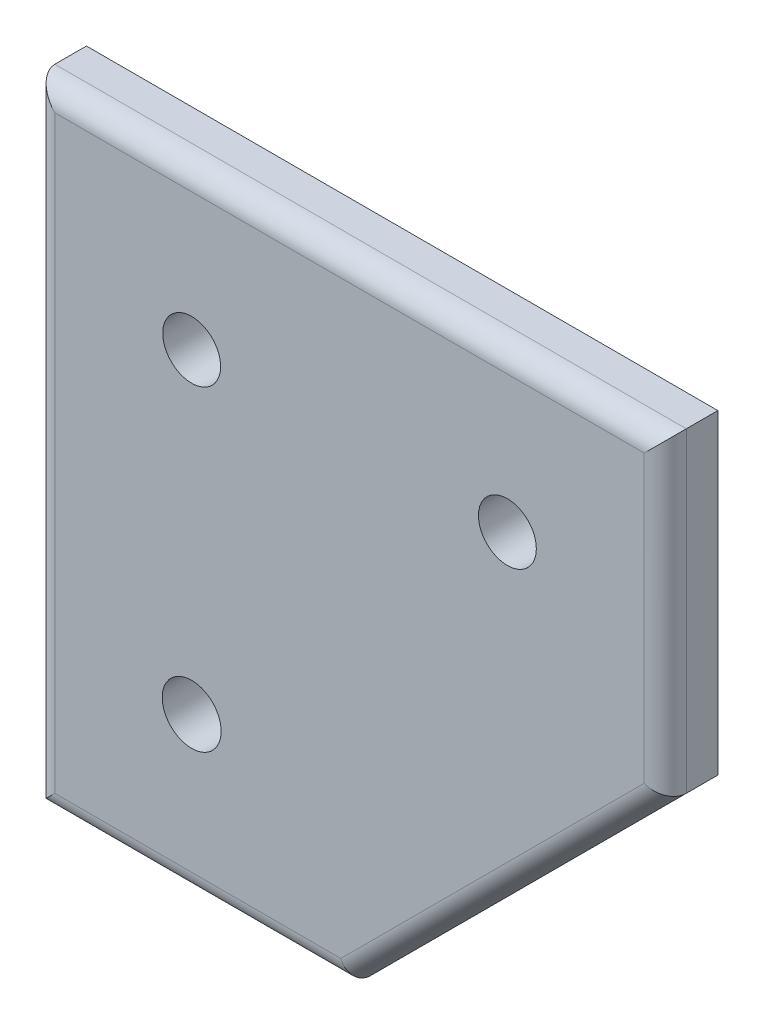
ISO-10303-21;
HEADER;
FILE_DESCRIPTION(('STEP AP214'),'2;1');
FILE_NAME('part.step','',(''),(''),'','','');
FILE_SCHEMA(('AUTOMOTIVE_DESIGN { 1 0 10303 214 1 1 1 1 }'));
ENDSEC;
DATA;
#1=APPLICATION_CONTEXT('core data for automotive mechanical design processes');
#2=APPLICATION_PROTOCOL_DEFINITION('international standard','automotive_design',2000,#1);
#3=PRODUCT_CONTEXT('',#1,'mechanical');
#4=PRODUCT('Part','Part','',(#3));
#5=PRODUCT_RELATED_PRODUCT_CATEGORY('part','',(#4));
#6=PRODUCT_DEFINITION_FORMATION('','',#4);
#7=PRODUCT_DEFINITION_CONTEXT('part definition',#1,'design');
#8=PRODUCT_DEFINITION('design','',#6,#7);
#9=PRODUCT_DEFINITION_SHAPE('','',#8);
#10=(LENGTH_UNIT() NAMED_UNIT(*) SI_UNIT(.MILLI.,.METRE.));
#11=(NAMED_UNIT(*) PLANE_ANGLE_UNIT() SI_UNIT($,.RADIAN.));
#12=(NAMED_UNIT(*) SI_UNIT($,.STERADIAN.) SOLID_ANGLE_UNIT());
#13=UNCERTAINTY_MEASURE_WITH_UNIT(LENGTH_MEASURE(1.E-05),#10,'distance_accuracy_value','');
#14=(GEOMETRIC_REPRESENTATION_CONTEXT(3) GLOBAL_UNCERTAINTY_ASSIGNED_CONTEXT((#13)) GLOBAL_UNIT_ASSIGNED_CONTEXT((#10,
#11,#12)) REPRESENTATION_CONTEXT('',''));
#15=CARTESIAN_POINT('',(0.,0.,0.));
#16=DIRECTION('',(0.,0.,1.));
#17=DIRECTION('',(1.,0.,0.));
#18=AXIS2_PLACEMENT_3D('',#15,#16,#17);
#19=CARTESIAN_POINT('',(0.,-38.1,6.35));
#20=DIRECTION('',(0.,1.,0.));
#21=DIRECTION('',(0.,0.,1.));
#22=AXIS2_PLACEMENT_3D('',#19,#20,#21);
#23=PLANE('',#22);
#24=DIRECTION('',(0.,0.,-1.));
#25=VECTOR('',#24,1.);
#26=CARTESIAN_POINT('',(38.1,-38.1,6.35));
#27=LINE('',#26,#25);
#28=CARTESIAN_POINT('',(38.1,-38.1,3.81));
#29=VERTEX_POINT('',#28);
#30=CARTESIAN_POINT('',(38.1,-38.1,0.));
#31=VERTEX_POINT('',#30);
#32=EDGE_CURVE('E113',#29,#31,#27,.T.);
#33=ORIENTED_EDGE('',*,*,#32,.F.);
#34=DIRECTION('',(1.,0.,0.));
#35=VECTOR('',#34,1.);
#36=CARTESIAN_POINT('',(0.,-38.1,3.81));
#37=LINE('',#36,#35);
#38=CARTESIAN_POINT('',(0.,-38.1,3.81));
#39=VERTEX_POINT('',#38);
#40=EDGE_CURVE('E111',#29,#39,#37,.F.);
#41=ORIENTED_EDGE('',*,*,#40,.T.);
#42=DIRECTION('',(0.,0.,-1.));
#43=VECTOR('',#42,1.);
#44=CARTESIAN_POINT('',(0.,-38.1,6.35));
#45=LINE('',#44,#43);
#46=CARTESIAN_POINT('',(0.,-38.1,0.));
#47=VERTEX_POINT('',#46);
#48=EDGE_CURVE('E104',#39,#47,#45,.T.);
#49=ORIENTED_EDGE('',*,*,#48,.T.);
#50=DIRECTION('',(1.,0.,0.));
#51=VECTOR('',#50,1.);
#52=CARTESIAN_POINT('',(0.,-38.1,0.));
#53=LINE('',#52,#51);
#54=EDGE_CURVE('E108',#47,#31,#53,.T.);
#55=ORIENTED_EDGE('',*,*,#54,.T.);
#56=EDGE_LOOP('',(#33,#41,#49,#55));
#57=FACE_BOUND('',#56,.T.);
#58=ADVANCED_FACE('F43',(#57),#23,.F.);
#59=CARTESIAN_POINT('',(38.1,-38.1,6.35));
#60=DIRECTION('',(-0.707106781186548,0.707106781186547,0.));
#61=DIRECTION('',(-0.707106781186547,-0.707106781186548,0.));
#62=AXIS2_PLACEMENT_3D('',#59,#60,#61);
#63=PLANE('',#62);
#64=DIRECTION('',(0.,0.,-1.));
#65=VECTOR('',#64,1.);
#66=CARTESIAN_POINT('',(76.2,0.,6.35));
#67=LINE('',#66,#65);
#68=CARTESIAN_POINT('',(76.2,0.,3.81));
#69=VERTEX_POINT('',#68);
#70=CARTESIAN_POINT('',(76.2,0.,0.));
#71=VERTEX_POINT('',#70);
#72=EDGE_CURVE('E143',#69,#71,#67,.T.);
#73=ORIENTED_EDGE('',*,*,#72,.F.);
#74=DIRECTION('',(0.707106781186547,0.707106781186548,0.));
#75=VECTOR('',#74,1.);
#76=CARTESIAN_POINT('',(38.1,-38.1,3.81));
#77=LINE('',#76,#75);
#78=EDGE_CURVE('E156',#69,#29,#77,.F.);
#79=ORIENTED_EDGE('',*,*,#78,.T.);
#80=ORIENTED_EDGE('',*,*,#32,.T.);
#81=DIRECTION('',(0.707106781186548,0.707106781186548,0.));
#82=VECTOR('',#81,1.);
#83=CARTESIAN_POINT('',(38.1,-38.1,0.));
#84=LINE('',#83,#82);
#85=EDGE_CURVE('E127',#31,#71,#84,.T.);
#86=ORIENTED_EDGE('',*,*,#85,.T.);
#87=EDGE_LOOP('',(#73,#79,#80,#86));
#88=FACE_BOUND('',#87,.T.);
#89=ADVANCED_FACE('F214',(#88),#63,.F.);
#90=CARTESIAN_POINT('',(76.2,0.,6.35));
#91=DIRECTION('',(-1.,0.,0.));
#92=DIRECTION('',(0.,0.,1.));
#93=AXIS2_PLACEMENT_3D('',#90,#91,#92);
#94=PLANE('',#93);
#95=DIRECTION('',(0.,0.,-1.));
#96=VECTOR('',#95,1.);
#97=CARTESIAN_POINT('',(76.2,38.1,6.35));
#98=LINE('',#97,#96);
#99=CARTESIAN_POINT('',(76.2,38.1,3.81));
#100=VERTEX_POINT('',#99);
#101=CARTESIAN_POINT('',(76.2,38.1,0.));
#102=VERTEX_POINT('',#101);
#103=EDGE_CURVE('E141',#100,#102,#98,.T.);
#104=ORIENTED_EDGE('',*,*,#103,.F.);
#105=DIRECTION('',(0.,1.,0.));
#106=VECTOR('',#105,1.);
#107=CARTESIAN_POINT('',(76.2,0.,3.81));
#108=LINE('',#107,#106);
#109=EDGE_CURVE('E160',#100,#69,#108,.F.);
#110=ORIENTED_EDGE('',*,*,#109,.T.);
#111=ORIENTED_EDGE('',*,*,#72,.T.);
#112=DIRECTION('',(0.,1.,0.));
#113=VECTOR('',#112,1.);
#114=CARTESIAN_POINT('',(76.2,0.,0.));
#115=LINE('',#114,#113);
#116=EDGE_CURVE('E130',#71,#102,#115,.T.);
#117=ORIENTED_EDGE('',*,*,#116,.T.);
#118=EDGE_LOOP('',(#104,#110,#111,#117));
#119=FACE_BOUND('',#118,.T.);
#120=ADVANCED_FACE('F220',(#119),#94,.F.);
#121=CARTESIAN_POINT('',(0.,38.1,6.35));
#122=DIRECTION('',(0.,-1.,0.));
#123=DIRECTION('',(0.,0.,-1.));
#124=AXIS2_PLACEMENT_3D('',#121,#122,#123);
#125=PLANE('',#124);
#126=DIRECTION('',(0.,0.,-1.));
#127=VECTOR('',#126,1.);
#128=CARTESIAN_POINT('',(0.,38.1,6.35));
#129=LINE('',#128,#127);
#130=CARTESIAN_POINT('',(0.,38.1,3.81));
#131=VERTEX_POINT('',#130);
#132=CARTESIAN_POINT('',(0.,38.1,0.));
#133=VERTEX_POINT('',#132);
#134=EDGE_CURVE('E118',#131,#133,#129,.T.);
#135=ORIENTED_EDGE('',*,*,#134,.F.);
#136=DIRECTION('',(-1.,0.,0.));
#137=VECTOR('',#136,1.);
#138=CARTESIAN_POINT('',(76.2,38.1,3.81));
#139=LINE('',#138,#137);
#140=EDGE_CURVE('E52',#131,#100,#139,.F.);
#141=ORIENTED_EDGE('',*,*,#140,.T.);
#142=ORIENTED_EDGE('',*,*,#103,.T.);
#143=DIRECTION('',(-1.,0.,0.));
#144=VECTOR('',#143,1.);
#145=CARTESIAN_POINT('',(0.,38.1,0.));
#146=LINE('',#145,#144);
#147=EDGE_CURVE('E122',#102,#133,#146,.T.);
#148=ORIENTED_EDGE('',*,*,#147,.T.);
#149=EDGE_LOOP('',(#135,#141,#142,#148));
#150=FACE_BOUND('',#149,.T.);
#151=ADVANCED_FACE('F209',(#150),#125,.F.);
#152=CARTESIAN_POINT('',(0.,0.,6.35));
#153=DIRECTION('',(1.,0.,0.));
#154=DIRECTION('',(0.,0.,-1.));
#155=AXIS2_PLACEMENT_3D('',#152,#153,#154);
#156=PLANE('',#155);
#157=ORIENTED_EDGE('',*,*,#48,.F.);
#158=DIRECTION('',(0.,-1.,0.));
#159=VECTOR('',#158,1.);
#160=CARTESIAN_POINT('',(0.,38.1,3.81));
#161=LINE('',#160,#159);
#162=EDGE_CURVE('E11',#39,#131,#161,.F.);
#163=ORIENTED_EDGE('',*,*,#162,.T.);
#164=ORIENTED_EDGE('',*,*,#134,.T.);
#165=DIRECTION('',(0.,-1.,0.));
#166=VECTOR('',#165,1.);
#167=CARTESIAN_POINT('',(0.,0.,0.));
#168=LINE('',#167,#166);
#169=EDGE_CURVE('E116',#133,#47,#168,.T.);
#170=ORIENTED_EDGE('',*,*,#169,.T.);
#171=EDGE_LOOP('',(#157,#163,#164,#170));
#172=FACE_BOUND('',#171,.T.);
#173=ADVANCED_FACE('F117',(#172),#156,.F.);
#174=CARTESIAN_POINT('',(0.,0.,6.35));
#175=DIRECTION('',(0.,0.,1.));
#176=DIRECTION('',(1.,0.,0.));
#177=AXIS2_PLACEMENT_3D('',#174,#175,#176);
#178=PLANE('',#177);
#179=DIRECTION('',(1.,0.,0.));
#180=VECTOR('',#179,1.);
#181=CARTESIAN_POINT('',(38.1,-35.56,6.35));
#182=LINE('',#181,#180);
#183=CARTESIAN_POINT('',(2.54,-35.56,6.35));
#184=VERTEX_POINT('',#183);
#185=CARTESIAN_POINT('',(37.0478975515724,-35.56,6.35));
#186=VERTEX_POINT('',#185);
#187=EDGE_CURVE('E151',#184,#186,#182,.T.);
#188=ORIENTED_EDGE('',*,*,#187,.T.);
#189=DIRECTION('',(0.707106781186547,0.707106781186548,0.));
#190=VECTOR('',#189,1.);
#191=CARTESIAN_POINT('',(74.4039487757862,1.79605122421383,6.35));
#192=LINE('',#191,#190);
#193=CARTESIAN_POINT('',(73.66,1.05210244842766,6.35));
#194=VERTEX_POINT('',#193);
#195=EDGE_CURVE('E153',#186,#194,#192,.T.);
#196=ORIENTED_EDGE('',*,*,#195,.T.);
#197=DIRECTION('',(0.,1.,0.));
#198=VECTOR('',#197,1.);
#199=CARTESIAN_POINT('',(73.66,38.1,6.35));
#200=LINE('',#199,#198);
#201=CARTESIAN_POINT('',(73.66,35.56,6.35));
#202=VERTEX_POINT('',#201);
#203=EDGE_CURVE('E149',#194,#202,#200,.T.);
#204=ORIENTED_EDGE('',*,*,#203,.T.);
#205=DIRECTION('',(-1.,0.,0.));
#206=VECTOR('',#205,1.);
#207=CARTESIAN_POINT('',(0.,35.56,6.35));
#208=LINE('',#207,#206);
#209=CARTESIAN_POINT('',(2.54,35.56,6.35));
#210=VERTEX_POINT('',#209);
#211=EDGE_CURVE('E147',#202,#210,#208,.T.);
#212=ORIENTED_EDGE('',*,*,#211,.T.);
#213=DIRECTION('',(0.,-1.,0.));
#214=VECTOR('',#213,1.);
#215=CARTESIAN_POINT('',(2.54,-38.1,6.35));
#216=LINE('',#215,#214);
#217=EDGE_CURVE('E112',#210,#184,#216,.T.);
#218=ORIENTED_EDGE('',*,*,#217,.T.);
#219=EDGE_LOOP('',(#188,#196,#204,#212,#218));
#220=FACE_BOUND('',#219,.T.);
#221=CARTESIAN_POINT('',(19.05,-19.05,6.35));
#222=DIRECTION('',(0.,0.,1.));
#223=DIRECTION('',(1.,0.,0.));
#224=AXIS2_PLACEMENT_3D('',#221,#222,#223);
#225=CIRCLE('',#224,3.556);
#226=CARTESIAN_POINT('',(22.606,-19.05,6.35));
#227=VERTEX_POINT('',#226);
#228=EDGE_CURVE('E180',#227,#227,#225,.T.);
#229=ORIENTED_EDGE('',*,*,#228,.F.);
#230=EDGE_LOOP('',(#229));
#231=FACE_BOUND('',#230,.T.);
#232=CARTESIAN_POINT('',(57.15,19.05,6.35));
#233=DIRECTION('',(0.,0.,1.));
#234=DIRECTION('',(1.,0.,0.));
#235=AXIS2_PLACEMENT_3D('',#232,#233,#234);
#236=CIRCLE('',#235,3.4925);
#237=CARTESIAN_POINT('',(60.6425,19.05,6.35));
#238=VERTEX_POINT('',#237);
#239=EDGE_CURVE('E190',#238,#238,#236,.T.);
#240=ORIENTED_EDGE('',*,*,#239,.F.);
#241=EDGE_LOOP('',(#240));
#242=FACE_BOUND('',#241,.T.);
#243=CARTESIAN_POINT('',(19.05,19.05,6.35));
#244=DIRECTION('',(0.,0.,1.));
#245=DIRECTION('',(1.,0.,0.));
#246=AXIS2_PLACEMENT_3D('',#243,#244,#245);
#247=CIRCLE('',#246,3.4925);
#248=CARTESIAN_POINT('',(22.5425,19.05,6.35));
#249=VERTEX_POINT('',#248);
#250=EDGE_CURVE('E133',#249,#249,#247,.T.);
#251=ORIENTED_EDGE('',*,*,#250,.F.);
#252=EDGE_LOOP('',(#251));
#253=FACE_BOUND('',#252,.T.);
#254=ADVANCED_FACE('F199',(#220,#231,#242,#253),#178,.T.);
#255=CARTESIAN_POINT('',(0.,0.,0.));
#256=DIRECTION('',(0.,0.,1.));
#257=DIRECTION('',(1.,0.,0.));
#258=AXIS2_PLACEMENT_3D('',#255,#256,#257);
#259=PLANE('',#258);
#260=CARTESIAN_POINT('',(19.05,-19.05,0.));
#261=DIRECTION('',(0.,0.,1.));
#262=DIRECTION('',(1.,0.,0.));
#263=AXIS2_PLACEMENT_3D('',#260,#261,#262);
#264=CIRCLE('',#263,3.556);
#265=CARTESIAN_POINT('',(22.606,-19.05,0.));
#266=VERTEX_POINT('',#265);
#267=EDGE_CURVE('E175',#266,#266,#264,.T.);
#268=ORIENTED_EDGE('',*,*,#267,.T.);
#269=EDGE_LOOP('',(#268));
#270=FACE_BOUND('',#269,.T.);
#271=CARTESIAN_POINT('',(57.15,19.05,0.));
#272=DIRECTION('',(0.,0.,1.));
#273=DIRECTION('',(1.,0.,0.));
#274=AXIS2_PLACEMENT_3D('',#271,#272,#273);
#275=CIRCLE('',#274,3.4925);
#276=CARTESIAN_POINT('',(60.6425,19.05,0.));
#277=VERTEX_POINT('',#276);
#278=EDGE_CURVE('E185',#277,#277,#275,.T.);
#279=ORIENTED_EDGE('',*,*,#278,.T.);
#280=EDGE_LOOP('',(#279));
#281=FACE_BOUND('',#280,.T.);
#282=CARTESIAN_POINT('',(19.05,19.05,0.));
#283=DIRECTION('',(0.,0.,1.));
#284=DIRECTION('',(1.,0.,0.));
#285=AXIS2_PLACEMENT_3D('',#282,#283,#284);
#286=CIRCLE('',#285,3.4925);
#287=CARTESIAN_POINT('',(22.5425,19.05,0.));
#288=VERTEX_POINT('',#287);
#289=EDGE_CURVE('E128',#288,#288,#286,.T.);
#290=ORIENTED_EDGE('',*,*,#289,.T.);
#291=EDGE_LOOP('',(#290));
#292=FACE_BOUND('',#291,.T.);
#293=ORIENTED_EDGE('',*,*,#54,.F.);
#294=ORIENTED_EDGE('',*,*,#169,.F.);
#295=ORIENTED_EDGE('',*,*,#147,.F.);
#296=ORIENTED_EDGE('',*,*,#116,.F.);
#297=ORIENTED_EDGE('',*,*,#85,.F.);
#298=EDGE_LOOP('',(#293,#294,#295,#296,#297));
#299=FACE_BOUND('',#298,.T.);
#300=ADVANCED_FACE('F124',(#270,#281,#292,#299),#259,.F.);
#301=CARTESIAN_POINT('',(19.05,19.05,0.));
#302=DIRECTION('',(0.,0.,1.));
#303=DIRECTION('',(1.,0.,0.));
#304=AXIS2_PLACEMENT_3D('',#301,#302,#303);
#305=CYLINDRICAL_SURFACE('',#304,3.4925);
#306=ORIENTED_EDGE('',*,*,#289,.F.);
#307=EDGE_LOOP('',(#306));
#308=FACE_BOUND('',#307,.T.);
#309=ORIENTED_EDGE('',*,*,#250,.T.);
#310=EDGE_LOOP('',(#309));
#311=FACE_BOUND('',#310,.T.);
#312=ADVANCED_FACE('F197',(#308,#311),#305,.F.);
#313=CARTESIAN_POINT('',(57.15,19.05,0.));
#314=DIRECTION('',(0.,0.,1.));
#315=DIRECTION('',(1.,0.,0.));
#316=AXIS2_PLACEMENT_3D('',#313,#314,#315);
#317=CYLINDRICAL_SURFACE('',#316,3.4925);
#318=ORIENTED_EDGE('',*,*,#278,.F.);
#319=EDGE_LOOP('',(#318));
#320=FACE_BOUND('',#319,.T.);
#321=ORIENTED_EDGE('',*,*,#239,.T.);
#322=EDGE_LOOP('',(#321));
#323=FACE_BOUND('',#322,.T.);
#324=ADVANCED_FACE('F243',(#320,#323),#317,.F.);
#325=CARTESIAN_POINT('',(19.05,-19.05,0.));
#326=DIRECTION('',(0.,0.,1.));
#327=DIRECTION('',(1.,0.,0.));
#328=AXIS2_PLACEMENT_3D('',#325,#326,#327);
#329=CYLINDRICAL_SURFACE('',#328,3.556);
#330=ORIENTED_EDGE('',*,*,#267,.F.);
#331=EDGE_LOOP('',(#330));
#332=FACE_BOUND('',#331,.T.);
#333=ORIENTED_EDGE('',*,*,#228,.T.);
#334=EDGE_LOOP('',(#333));
#335=FACE_BOUND('',#334,.T.);
#336=ADVANCED_FACE('F239',(#332,#335),#329,.F.);
#337=CARTESIAN_POINT('',(2.54,0.,3.81));
#338=DIRECTION('',(0.,1.,0.));
#339=DIRECTION('',(0.,0.,1.));
#340=AXIS2_PLACEMENT_3D('',#337,#338,#339);
#341=CYLINDRICAL_SURFACE('',#340,2.54);
#342=CARTESIAN_POINT('',(2.54,-35.56,3.81));
#343=DIRECTION('',(-0.707106781186547,0.707106781186547,0.));
#344=DIRECTION('',(0.707106781186547,0.707106781186547,0.));
#345=AXIS2_PLACEMENT_3D('',#342,#343,#344);
#346=ELLIPSE('',#345,3.59210244842766,2.54);
#347=EDGE_CURVE('E169',#184,#39,#346,.F.);
#348=ORIENTED_EDGE('',*,*,#347,.F.);
#349=ORIENTED_EDGE('',*,*,#217,.F.);
#350=CARTESIAN_POINT('',(2.54,35.56,3.81));
#351=DIRECTION('',(0.707106781186547,0.707106781186547,0.));
#352=DIRECTION('',(-0.707106781186547,0.707106781186547,0.));
#353=AXIS2_PLACEMENT_3D('',#350,#351,#352);
#354=ELLIPSE('',#353,3.59210244842766,2.54);
#355=EDGE_CURVE('E47',#131,#210,#354,.T.);
#356=ORIENTED_EDGE('',*,*,#355,.F.);
#357=ORIENTED_EDGE('',*,*,#162,.F.);
#358=EDGE_LOOP('',(#348,#349,#356,#357));
#359=FACE_BOUND('',#358,.T.);
#360=ADVANCED_FACE('F45',(#359),#341,.T.);
#361=CARTESIAN_POINT('',(0.,35.56,3.81));
#362=DIRECTION('',(1.,0.,0.));
#363=DIRECTION('',(0.,0.,-1.));
#364=AXIS2_PLACEMENT_3D('',#361,#362,#363);
#365=CYLINDRICAL_SURFACE('',#364,2.54);
#366=ORIENTED_EDGE('',*,*,#355,.T.);
#367=ORIENTED_EDGE('',*,*,#211,.F.);
#368=CARTESIAN_POINT('',(73.66,35.56,3.81));
#369=DIRECTION('',(0.707106781186547,-0.707106781186547,0.));
#370=DIRECTION('',(0.707106781186547,0.707106781186547,0.));
#371=AXIS2_PLACEMENT_3D('',#368,#369,#370);
#372=ELLIPSE('',#371,3.59210244842766,2.54);
#373=EDGE_CURVE('E167',#100,#202,#372,.T.);
#374=ORIENTED_EDGE('',*,*,#373,.F.);
#375=ORIENTED_EDGE('',*,*,#140,.F.);
#376=EDGE_LOOP('',(#366,#367,#374,#375));
#377=FACE_BOUND('',#376,.T.);
#378=ADVANCED_FACE('F235',(#377),#365,.T.);
#379=CARTESIAN_POINT('',(0.,-35.56,3.81));
#380=DIRECTION('',(-1.,0.,0.));
#381=DIRECTION('',(0.,0.,1.));
#382=AXIS2_PLACEMENT_3D('',#379,#380,#381);
#383=CYLINDRICAL_SURFACE('',#382,2.54);
#384=ORIENTED_EDGE('',*,*,#347,.T.);
#385=ORIENTED_EDGE('',*,*,#40,.F.);
#386=CARTESIAN_POINT('',(37.0478975515724,-35.56,3.81));
#387=DIRECTION('',(-0.923879532511287,-0.38268343236509,0.));
#388=DIRECTION('',(-0.38268343236509,0.923879532511287,0.));
#389=AXIS2_PLACEMENT_3D('',#386,#387,#388);
#390=ELLIPSE('',#389,2.74927618874268,2.54);
#391=EDGE_CURVE('E165',#186,#29,#390,.F.);
#392=ORIENTED_EDGE('',*,*,#391,.F.);
#393=ORIENTED_EDGE('',*,*,#187,.F.);
#394=EDGE_LOOP('',(#384,#385,#392,#393));
#395=FACE_BOUND('',#394,.T.);
#396=ADVANCED_FACE('F232',(#395),#383,.T.);
#397=CARTESIAN_POINT('',(73.66,0.,3.81));
#398=DIRECTION('',(0.,-1.,0.));
#399=DIRECTION('',(0.,0.,-1.));
#400=AXIS2_PLACEMENT_3D('',#397,#398,#399);
#401=CYLINDRICAL_SURFACE('',#400,2.54);
#402=ORIENTED_EDGE('',*,*,#373,.T.);
#403=ORIENTED_EDGE('',*,*,#203,.F.);
#404=CARTESIAN_POINT('',(73.66,1.05210244842767,3.81));
#405=DIRECTION('',(-0.38268343236509,-0.923879532511287,0.));
#406=DIRECTION('',(0.923879532511287,-0.38268343236509,0.));
#407=AXIS2_PLACEMENT_3D('',#404,#405,#406);
#408=ELLIPSE('',#407,2.74927618874268,2.54);
#409=EDGE_CURVE('E163',#69,#194,#408,.T.);
#410=ORIENTED_EDGE('',*,*,#409,.F.);
#411=ORIENTED_EDGE('',*,*,#109,.F.);
#412=EDGE_LOOP('',(#402,#403,#410,#411));
#413=FACE_BOUND('',#412,.T.);
#414=ADVANCED_FACE('F228',(#413),#401,.T.);
#415=CARTESIAN_POINT('',(36.3039487757862,-36.3039487757862,3.81));
#416=DIRECTION('',(-0.707106781186547,-0.707106781186548,0.));
#417=DIRECTION('',(0.707106781186548,-0.707106781186547,0.));
#418=AXIS2_PLACEMENT_3D('',#415,#416,#417);
#419=CYLINDRICAL_SURFACE('',#418,2.54);
#420=ORIENTED_EDGE('',*,*,#391,.T.);
#421=ORIENTED_EDGE('',*,*,#78,.F.);
#422=ORIENTED_EDGE('',*,*,#409,.T.);
#423=ORIENTED_EDGE('',*,*,#195,.F.);
#424=EDGE_LOOP('',(#420,#421,#422,#423));
#425=FACE_BOUND('',#424,.T.);
#426=ADVANCED_FACE('F225',(#425),#419,.T.);
#427=CLOSED_SHELL('',(#58,#89,#120,#151,#173,#254,#300,#312,#324,#336,#360,#378,#396,#414,#426));
#428=MANIFOLD_SOLID_BREP('B2',#427);
#429=ADVANCED_BREP_SHAPE_REPRESENTATION('',(#18,#428),#14);
#430=SHAPE_DEFINITION_REPRESENTATION(#9,#429);
ENDSEC;
END-ISO-10303-21;
